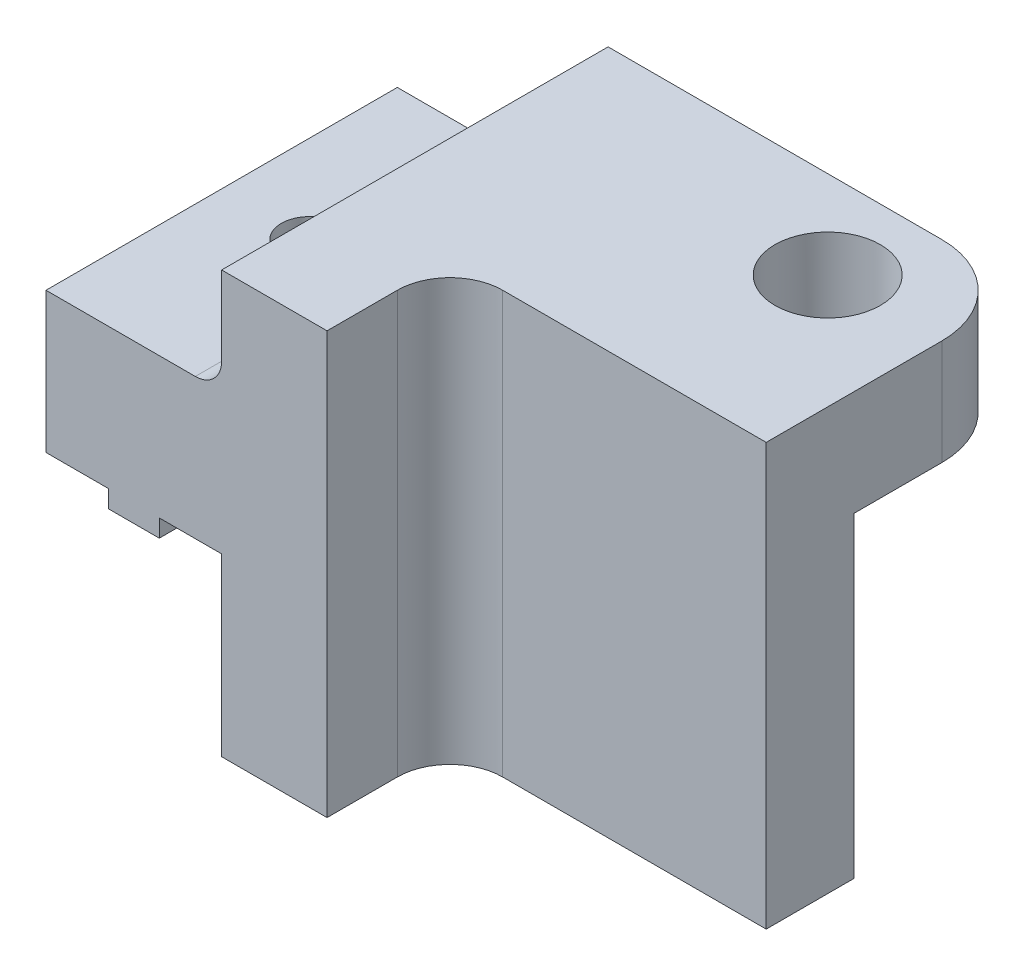
ISO-10303-21;
HEADER;
FILE_DESCRIPTION(('STEP AP214'),'2;1');
FILE_NAME('part.step','',(''),(''),'','','');
FILE_SCHEMA(('AUTOMOTIVE_DESIGN { 1 0 10303 214 1 1 1 1 }'));
ENDSEC;
DATA;
#1=APPLICATION_CONTEXT('core data for automotive mechanical design processes');
#2=APPLICATION_PROTOCOL_DEFINITION('international standard','automotive_design',2000,#1);
#3=PRODUCT_CONTEXT('',#1,'mechanical');
#4=PRODUCT('Part','Part','',(#3));
#5=PRODUCT_RELATED_PRODUCT_CATEGORY('part','',(#4));
#6=PRODUCT_DEFINITION_FORMATION('','',#4);
#7=PRODUCT_DEFINITION_CONTEXT('part definition',#1,'design');
#8=PRODUCT_DEFINITION('design','',#6,#7);
#9=PRODUCT_DEFINITION_SHAPE('','',#8);
#10=(LENGTH_UNIT() NAMED_UNIT(*) SI_UNIT(.MILLI.,.METRE.));
#11=(NAMED_UNIT(*) PLANE_ANGLE_UNIT() SI_UNIT($,.RADIAN.));
#12=(NAMED_UNIT(*) SI_UNIT($,.STERADIAN.) SOLID_ANGLE_UNIT());
#13=UNCERTAINTY_MEASURE_WITH_UNIT(LENGTH_MEASURE(1.E-05),#10,'distance_accuracy_value','');
#14=(GEOMETRIC_REPRESENTATION_CONTEXT(3) GLOBAL_UNCERTAINTY_ASSIGNED_CONTEXT((#13)) GLOBAL_UNIT_ASSIGNED_CONTEXT((#10,
#11,#12)) REPRESENTATION_CONTEXT('',''));
#15=CARTESIAN_POINT('',(0.,0.,0.));
#16=DIRECTION('',(0.,0.,1.));
#17=DIRECTION('',(1.,0.,0.));
#18=AXIS2_PLACEMENT_3D('',#15,#16,#17);
#19=CARTESIAN_POINT('',(36.45,-2.00000000000001,22.));
#20=DIRECTION('',(-1.,0.,0.));
#21=DIRECTION('',(0.,1.,0.));
#22=AXIS2_PLACEMENT_3D('',#19,#20,#21);
#23=PLANE('',#22);
#24=DIRECTION('',(0.,0.,-1.));
#25=VECTOR('',#24,1.);
#26=CARTESIAN_POINT('',(36.45,-3.00000000000001,22.));
#27=LINE('',#26,#25);
#28=CARTESIAN_POINT('',(36.45,-3.00000000000001,11.3236125370765));
#29=VERTEX_POINT('',#28);
#30=CARTESIAN_POINT('',(36.45,-3.00000000000001,2.));
#31=VERTEX_POINT('',#30);
#32=EDGE_CURVE('E246',#29,#31,#27,.T.);
#33=ORIENTED_EDGE('',*,*,#32,.T.);
#34=DIRECTION('',(0.,-1.,0.));
#35=VECTOR('',#34,1.);
#36=CARTESIAN_POINT('',(36.45,-2.00000000000001,2.));
#37=LINE('',#36,#35);
#38=CARTESIAN_POINT('',(36.45,-2.00000000000001,2.));
#39=VERTEX_POINT('',#38);
#40=EDGE_CURVE('E457',#39,#31,#37,.T.);
#41=ORIENTED_EDGE('',*,*,#40,.F.);
#42=DIRECTION('',(0.,0.,-1.));
#43=VECTOR('',#42,1.);
#44=CARTESIAN_POINT('',(36.45,-2.00000000000001,22.));
#45=LINE('',#44,#43);
#46=CARTESIAN_POINT('',(36.45,-2.00000000000001,11.3236125370764));
#47=VERTEX_POINT('',#46);
#48=EDGE_CURVE('E250',#47,#39,#45,.T.);
#49=ORIENTED_EDGE('',*,*,#48,.F.);
#50=DIRECTION('',(0.,1.,0.));
#51=VECTOR('',#50,1.);
#52=CARTESIAN_POINT('',(36.45,-12.,11.3236125370764));
#53=LINE('',#52,#51);
#54=EDGE_CURVE('E521',#29,#47,#53,.T.);
#55=ORIENTED_EDGE('',*,*,#54,.F.);
#56=EDGE_LOOP('',(#33,#41,#49,#55));
#57=FACE_BOUND('',#56,.T.);
#58=ADVANCED_FACE('F33',(#57),#23,.F.);
#59=CARTESIAN_POINT('',(36.45,-3.00000000000001,22.));
#60=DIRECTION('',(0.,1.,0.));
#61=DIRECTION('',(1.,0.,0.));
#62=AXIS2_PLACEMENT_3D('',#59,#60,#61);
#63=PLANE('',#62);
#64=CARTESIAN_POINT('',(36.45,-3.00000000000001,22.));
#65=VERTEX_POINT('',#64);
#66=CARTESIAN_POINT('',(36.45,-3.00000000000001,12.6763874629234));
#67=VERTEX_POINT('',#66);
#68=EDGE_CURVE('E247',#65,#67,#27,.T.);
#69=ORIENTED_EDGE('',*,*,#68,.F.);
#70=DIRECTION('',(-1.,0.,0.));
#71=VECTOR('',#70,1.);
#72=CARTESIAN_POINT('',(36.45,-3.00000000000001,22.));
#73=LINE('',#72,#71);
#74=CARTESIAN_POINT('',(33.55,-3.00000000000001,22.));
#75=VERTEX_POINT('',#74);
#76=EDGE_CURVE('E390',#65,#75,#73,.T.);
#77=ORIENTED_EDGE('',*,*,#76,.T.);
#78=DIRECTION('',(0.,0.,-1.));
#79=VECTOR('',#78,1.);
#80=CARTESIAN_POINT('',(33.55,-3.00000000000001,22.));
#81=LINE('',#80,#79);
#82=CARTESIAN_POINT('',(33.5500000000001,-3.00000000000001,12.6763874629236));
#83=VERTEX_POINT('',#82);
#84=EDGE_CURVE('E240',#75,#83,#81,.T.);
#85=ORIENTED_EDGE('',*,*,#84,.T.);
#86=CARTESIAN_POINT('',(35.,-3.00000000000001,12.));
#87=DIRECTION('',(0.,-1.,0.));
#88=DIRECTION('',(1.,0.,0.));
#89=AXIS2_PLACEMENT_3D('',#86,#87,#88);
#90=CIRCLE('',#89,1.6);
#91=EDGE_CURVE('E228',#67,#83,#90,.T.);
#92=ORIENTED_EDGE('',*,*,#91,.F.);
#93=EDGE_LOOP('',(#69,#77,#85,#92));
#94=FACE_BOUND('',#93,.T.);
#95=ADVANCED_FACE('F499',(#94),#63,.F.);
#96=CARTESIAN_POINT('',(33.55,-3.00000000000001,22.));
#97=DIRECTION('',(1.,0.,0.));
#98=DIRECTION('',(0.,-1.,0.));
#99=AXIS2_PLACEMENT_3D('',#96,#97,#98);
#100=PLANE('',#99);
#101=ORIENTED_EDGE('',*,*,#84,.F.);
#102=DIRECTION('',(0.,1.,0.));
#103=VECTOR('',#102,1.);
#104=CARTESIAN_POINT('',(33.55,-3.00000000000001,22.));
#105=LINE('',#104,#103);
#106=CARTESIAN_POINT('',(33.55,-2.00000000000001,22.));
#107=VERTEX_POINT('',#106);
#108=EDGE_CURVE('E236',#75,#107,#105,.T.);
#109=ORIENTED_EDGE('',*,*,#108,.T.);
#110=DIRECTION('',(0.,0.,-1.));
#111=VECTOR('',#110,1.);
#112=CARTESIAN_POINT('',(33.55,-2.00000000000001,22.));
#113=LINE('',#112,#111);
#114=CARTESIAN_POINT('',(33.55,-2.00000000000001,12.6763874629234));
#115=VERTEX_POINT('',#114);
#116=EDGE_CURVE('E214',#107,#115,#113,.T.);
#117=ORIENTED_EDGE('',*,*,#116,.T.);
#118=DIRECTION('',(0.,1.,0.));
#119=VECTOR('',#118,1.);
#120=CARTESIAN_POINT('',(33.5500000000001,-12.,12.6763874629236));
#121=LINE('',#120,#119);
#122=EDGE_CURVE('E224',#83,#115,#121,.T.);
#123=ORIENTED_EDGE('',*,*,#122,.F.);
#124=EDGE_LOOP('',(#101,#109,#117,#123));
#125=FACE_BOUND('',#124,.T.);
#126=ADVANCED_FACE('F235',(#125),#100,.F.);
#127=CARTESIAN_POINT('',(30.,-2.00000000000002,22.));
#128=DIRECTION('',(1.,0.,0.));
#129=DIRECTION('',(0.,-1.,0.));
#130=AXIS2_PLACEMENT_3D('',#127,#128,#129);
#131=PLANE('',#130);
#132=DIRECTION('',(0.,0.,-1.));
#133=VECTOR('',#132,1.);
#134=CARTESIAN_POINT('',(30.,-2.00000000000002,22.));
#135=LINE('',#134,#133);
#136=CARTESIAN_POINT('',(30.,-2.00000000000002,22.));
#137=VERTEX_POINT('',#136);
#138=CARTESIAN_POINT('',(30.,-2.00000000000001,2.));
#139=VERTEX_POINT('',#138);
#140=EDGE_CURVE('E242',#137,#139,#135,.T.);
#141=ORIENTED_EDGE('',*,*,#140,.F.);
#142=DIRECTION('',(0.,1.,0.));
#143=VECTOR('',#142,1.);
#144=CARTESIAN_POINT('',(30.,-2.00000000000002,22.));
#145=LINE('',#144,#143);
#146=CARTESIAN_POINT('',(30.,5.99999999999999,22.));
#147=VERTEX_POINT('',#146);
#148=EDGE_CURVE('E368',#137,#147,#145,.T.);
#149=ORIENTED_EDGE('',*,*,#148,.T.);
#150=DIRECTION('',(0.,0.,-1.));
#151=VECTOR('',#150,1.);
#152=CARTESIAN_POINT('',(30.,5.99999999999999,22.));
#153=LINE('',#152,#151);
#154=CARTESIAN_POINT('',(30.,5.99999999999999,2.));
#155=VERTEX_POINT('',#154);
#156=EDGE_CURVE('E269',#147,#155,#153,.T.);
#157=ORIENTED_EDGE('',*,*,#156,.T.);
#158=DIRECTION('',(0.,1.,0.));
#159=VECTOR('',#158,1.);
#160=CARTESIAN_POINT('',(30.,-12.,2.));
#161=LINE('',#160,#159);
#162=EDGE_CURVE('E462',#139,#155,#161,.T.);
#163=ORIENTED_EDGE('',*,*,#162,.F.);
#164=EDGE_LOOP('',(#141,#149,#157,#163));
#165=FACE_BOUND('',#164,.T.);
#166=ADVANCED_FACE('F541',(#165),#131,.F.);
#167=CARTESIAN_POINT('',(30.,5.99999999999999,22.));
#168=DIRECTION('',(0.,-1.,0.));
#169=DIRECTION('',(0.,0.,-1.));
#170=AXIS2_PLACEMENT_3D('',#167,#168,#169);
#171=PLANE('',#170);
#172=CARTESIAN_POINT('',(35.,5.99999999999999,12.));
#173=DIRECTION('',(0.,-1.,0.));
#174=DIRECTION('',(0.,0.,1.));
#175=AXIS2_PLACEMENT_3D('',#172,#173,#174);
#176=CIRCLE('',#175,1.6);
#177=CARTESIAN_POINT('',(35.,5.99999999999999,13.6));
#178=VERTEX_POINT('',#177);
#179=EDGE_CURVE('E529',#178,#178,#176,.T.);
#180=ORIENTED_EDGE('',*,*,#179,.T.);
#181=EDGE_LOOP('',(#180));
#182=FACE_BOUND('',#181,.T.);
#183=DIRECTION('',(-1.,0.,0.));
#184=VECTOR('',#183,1.);
#185=CARTESIAN_POINT('',(40.,5.99999999999999,2.));
#186=LINE('',#185,#184);
#187=CARTESIAN_POINT('',(38.5,5.99999999999999,2.));
#188=VERTEX_POINT('',#187);
#189=EDGE_CURVE('E463',#188,#155,#186,.T.);
#190=ORIENTED_EDGE('',*,*,#189,.T.);
#191=ORIENTED_EDGE('',*,*,#156,.F.);
#192=DIRECTION('',(1.,0.,0.));
#193=VECTOR('',#192,1.);
#194=CARTESIAN_POINT('',(30.,5.99999999999999,22.));
#195=LINE('',#194,#193);
#196=CARTESIAN_POINT('',(38.5,5.99999999999999,22.));
#197=VERTEX_POINT('',#196);
#198=EDGE_CURVE('E371',#147,#197,#195,.T.);
#199=ORIENTED_EDGE('',*,*,#198,.T.);
#200=DIRECTION('',(0.,0.,-1.));
#201=VECTOR('',#200,1.);
#202=CARTESIAN_POINT('',(38.5,5.99999999999999,22.));
#203=LINE('',#202,#201);
#204=EDGE_CURVE('E300',#188,#197,#203,.F.);
#205=ORIENTED_EDGE('',*,*,#204,.F.);
#206=EDGE_LOOP('',(#190,#191,#199,#205));
#207=FACE_BOUND('',#206,.T.);
#208=ADVANCED_FACE('F545',(#182,#207),#171,.F.);
#209=CARTESIAN_POINT('',(40.,12.,22.));
#210=DIRECTION('',(0.,-1.,0.));
#211=DIRECTION('',(0.,0.,-1.));
#212=AXIS2_PLACEMENT_3D('',#209,#210,#211);
#213=PLANE('',#212);
#214=CARTESIAN_POINT('',(57.5,12.,5.));
#215=DIRECTION('',(0.,1.,0.));
#216=DIRECTION('',(0.,0.,-1.));
#217=AXIS2_PLACEMENT_3D('',#214,#215,#216);
#218=CIRCLE('',#217,3.);
#219=CARTESIAN_POINT('',(57.5,12.,2.));
#220=VERTEX_POINT('',#219);
#221=EDGE_CURVE('E276',#220,#220,#218,.T.);
#222=ORIENTED_EDGE('',*,*,#221,.F.);
#223=EDGE_LOOP('',(#222));
#224=FACE_BOUND('',#223,.T.);
#225=DIRECTION('',(1.,0.,0.));
#226=VECTOR('',#225,1.);
#227=CARTESIAN_POINT('',(21.,12.,15.));
#228=LINE('',#227,#226);
#229=CARTESIAN_POINT('',(49.,12.,15.));
#230=VERTEX_POINT('',#229);
#231=CARTESIAN_POINT('',(64.,12.,15.));
#232=VERTEX_POINT('',#231);
#233=EDGE_CURVE('E320',#230,#232,#228,.T.);
#234=ORIENTED_EDGE('',*,*,#233,.T.);
#235=DIRECTION('',(0.,0.,-1.));
#236=VECTOR('',#235,1.);
#237=CARTESIAN_POINT('',(64.,12.,22.));
#238=LINE('',#237,#236);
#239=CARTESIAN_POINT('',(64.,12.,5.));
#240=VERTEX_POINT('',#239);
#241=EDGE_CURVE('E263',#232,#240,#238,.T.);
#242=ORIENTED_EDGE('',*,*,#241,.T.);
#243=CARTESIAN_POINT('',(59.,12.,5.));
#244=DIRECTION('',(0.,1.,0.));
#245=DIRECTION('',(0.,0.,-1.));
#246=AXIS2_PLACEMENT_3D('',#243,#244,#245);
#247=CIRCLE('',#246,5.);
#248=CARTESIAN_POINT('',(59.,12.,0.));
#249=VERTEX_POINT('',#248);
#250=EDGE_CURVE('E291',#249,#240,#247,.F.);
#251=ORIENTED_EDGE('',*,*,#250,.F.);
#252=DIRECTION('',(1.,0.,0.));
#253=VECTOR('',#252,1.);
#254=CARTESIAN_POINT('',(40.,12.,0.));
#255=LINE('',#254,#253);
#256=CARTESIAN_POINT('',(40.,12.,0.));
#257=VERTEX_POINT('',#256);
#258=EDGE_CURVE('E365',#257,#249,#255,.T.);
#259=ORIENTED_EDGE('',*,*,#258,.F.);
#260=DIRECTION('',(0.,0.,-1.));
#261=VECTOR('',#260,1.);
#262=CARTESIAN_POINT('',(40.,12.,22.));
#263=LINE('',#262,#261);
#264=CARTESIAN_POINT('',(40.,12.,22.));
#265=VERTEX_POINT('',#264);
#266=EDGE_CURVE('E266',#265,#257,#263,.T.);
#267=ORIENTED_EDGE('',*,*,#266,.F.);
#268=DIRECTION('',(1.,0.,0.));
#269=VECTOR('',#268,1.);
#270=CARTESIAN_POINT('',(40.,12.,22.));
#271=LINE('',#270,#269);
#272=CARTESIAN_POINT('',(46.,12.,22.));
#273=VERTEX_POINT('',#272);
#274=EDGE_CURVE('E377',#265,#273,#271,.T.);
#275=ORIENTED_EDGE('',*,*,#274,.T.);
#276=DIRECTION('',(0.,0.,-1.));
#277=VECTOR('',#276,1.);
#278=CARTESIAN_POINT('',(46.,12.,22.));
#279=LINE('',#278,#277);
#280=CARTESIAN_POINT('',(46.,12.,18.));
#281=VERTEX_POINT('',#280);
#282=EDGE_CURVE('E324',#273,#281,#279,.T.);
#283=ORIENTED_EDGE('',*,*,#282,.T.);
#284=CARTESIAN_POINT('',(49.,12.,18.));
#285=DIRECTION('',(0.,1.,0.));
#286=DIRECTION('',(0.,0.,-1.));
#287=AXIS2_PLACEMENT_3D('',#284,#285,#286);
#288=CIRCLE('',#287,3.);
#289=EDGE_CURVE('E11',#230,#281,#288,.T.);
#290=ORIENTED_EDGE('',*,*,#289,.F.);
#291=EDGE_LOOP('',(#234,#242,#251,#259,#267,#275,#283,#290));
#292=FACE_BOUND('',#291,.T.);
#293=ADVANCED_FACE('F414',(#224,#292),#213,.F.);
#294=CARTESIAN_POINT('',(64.,12.,22.));
#295=DIRECTION('',(-1.,0.,0.));
#296=DIRECTION('',(0.,0.,-1.));
#297=AXIS2_PLACEMENT_3D('',#294,#295,#296);
#298=PLANE('',#297);
#299=DIRECTION('',(0.,0.,-1.));
#300=VECTOR('',#299,1.);
#301=CARTESIAN_POINT('',(64.,-12.,22.));
#302=LINE('',#301,#300);
#303=CARTESIAN_POINT('',(64.,-12.,15.));
#304=VERTEX_POINT('',#303);
#305=CARTESIAN_POINT('',(64.,-12.,10.));
#306=VERTEX_POINT('',#305);
#307=EDGE_CURVE('E260',#304,#306,#302,.T.);
#308=ORIENTED_EDGE('',*,*,#307,.T.);
#309=DIRECTION('',(0.,-1.,0.));
#310=VECTOR('',#309,1.);
#311=CARTESIAN_POINT('',(64.,6.,10.));
#312=LINE('',#311,#310);
#313=CARTESIAN_POINT('',(64.,6.,10.));
#314=VERTEX_POINT('',#313);
#315=EDGE_CURVE('E348',#314,#306,#312,.T.);
#316=ORIENTED_EDGE('',*,*,#315,.F.);
#317=DIRECTION('',(0.,0.,1.));
#318=VECTOR('',#317,1.);
#319=CARTESIAN_POINT('',(64.,6.,10.));
#320=LINE('',#319,#318);
#321=CARTESIAN_POINT('',(64.,6.,5.));
#322=VERTEX_POINT('',#321);
#323=EDGE_CURVE('E351',#322,#314,#320,.T.);
#324=ORIENTED_EDGE('',*,*,#323,.F.);
#325=DIRECTION('',(0.,-1.,0.));
#326=VECTOR('',#325,1.);
#327=CARTESIAN_POINT('',(64.,12.,5.));
#328=LINE('',#327,#326);
#329=EDGE_CURVE('E286',#240,#322,#328,.T.);
#330=ORIENTED_EDGE('',*,*,#329,.F.);
#331=ORIENTED_EDGE('',*,*,#241,.F.);
#332=DIRECTION('',(0.,-1.,0.));
#333=VECTOR('',#332,1.);
#334=CARTESIAN_POINT('',(64.,-12.,15.));
#335=LINE('',#334,#333);
#336=EDGE_CURVE('E456',#232,#304,#335,.T.);
#337=ORIENTED_EDGE('',*,*,#336,.T.);
#338=EDGE_LOOP('',(#308,#316,#324,#330,#331,#337));
#339=FACE_BOUND('',#338,.T.);
#340=ADVANCED_FACE('F484',(#339),#298,.F.);
#341=CARTESIAN_POINT('',(64.,-12.,22.));
#342=DIRECTION('',(0.,1.,0.));
#343=DIRECTION('',(1.,0.,0.));
#344=AXIS2_PLACEMENT_3D('',#341,#342,#343);
#345=PLANE('',#344);
#346=DIRECTION('',(-1.,0.,0.));
#347=VECTOR('',#346,1.);
#348=CARTESIAN_POINT('',(64.,-12.,22.));
#349=LINE('',#348,#347);
#350=CARTESIAN_POINT('',(46.,-12.,22.));
#351=VERTEX_POINT('',#350);
#352=CARTESIAN_POINT('',(40.,-12.,22.));
#353=VERTEX_POINT('',#352);
#354=EDGE_CURVE('E380',#351,#353,#349,.T.);
#355=ORIENTED_EDGE('',*,*,#354,.T.);
#356=DIRECTION('',(0.,0.,-1.));
#357=VECTOR('',#356,1.);
#358=CARTESIAN_POINT('',(40.,-12.,22.));
#359=LINE('',#358,#357);
#360=CARTESIAN_POINT('',(40.,-12.,0.));
#361=VERTEX_POINT('',#360);
#362=EDGE_CURVE('E257',#353,#361,#359,.T.);
#363=ORIENTED_EDGE('',*,*,#362,.T.);
#364=DIRECTION('',(-1.,0.,0.));
#365=VECTOR('',#364,1.);
#366=CARTESIAN_POINT('',(64.,-12.,0.));
#367=LINE('',#366,#365);
#368=CARTESIAN_POINT('',(43.,-12.,0.));
#369=VERTEX_POINT('',#368);
#370=EDGE_CURVE('E398',#369,#361,#367,.T.);
#371=ORIENTED_EDGE('',*,*,#370,.F.);
#372=DIRECTION('',(0.,0.,-1.));
#373=VECTOR('',#372,1.);
#374=CARTESIAN_POINT('',(43.,-12.,33.259406699226));
#375=LINE('',#374,#373);
#376=CARTESIAN_POINT('',(43.,-12.,10.));
#377=VERTEX_POINT('',#376);
#378=EDGE_CURVE('E342',#377,#369,#375,.T.);
#379=ORIENTED_EDGE('',*,*,#378,.F.);
#380=DIRECTION('',(1.,0.,0.));
#381=VECTOR('',#380,1.);
#382=CARTESIAN_POINT('',(64.,-12.,10.));
#383=LINE('',#382,#381);
#384=EDGE_CURVE('E339',#377,#306,#383,.T.);
#385=ORIENTED_EDGE('',*,*,#384,.T.);
#386=ORIENTED_EDGE('',*,*,#307,.F.);
#387=DIRECTION('',(1.,0.,0.));
#388=VECTOR('',#387,1.);
#389=CARTESIAN_POINT('',(21.,-12.,15.));
#390=LINE('',#389,#388);
#391=CARTESIAN_POINT('',(49.,-12.,15.));
#392=VERTEX_POINT('',#391);
#393=EDGE_CURVE('E315',#392,#304,#390,.T.);
#394=ORIENTED_EDGE('',*,*,#393,.F.);
#395=CARTESIAN_POINT('',(49.,-12.,18.));
#396=DIRECTION('',(0.,-1.,0.));
#397=DIRECTION('',(1.,0.,0.));
#398=AXIS2_PLACEMENT_3D('',#395,#396,#397);
#399=CIRCLE('',#398,3.);
#400=CARTESIAN_POINT('',(46.,-12.,18.));
#401=VERTEX_POINT('',#400);
#402=EDGE_CURVE('E41',#401,#392,#399,.T.);
#403=ORIENTED_EDGE('',*,*,#402,.F.);
#404=DIRECTION('',(0.,0.,1.));
#405=VECTOR('',#404,1.);
#406=CARTESIAN_POINT('',(46.,-12.,22.));
#407=LINE('',#406,#405);
#408=EDGE_CURVE('E319',#401,#351,#407,.T.);
#409=ORIENTED_EDGE('',*,*,#408,.T.);
#410=EDGE_LOOP('',(#355,#363,#371,#379,#385,#386,#394,#403,#409));
#411=FACE_BOUND('',#410,.T.);
#412=ADVANCED_FACE('F317',(#411),#345,.F.);
#413=CARTESIAN_POINT('',(40.,-12.,22.));
#414=DIRECTION('',(1.,0.,0.));
#415=DIRECTION('',(0.,-1.,0.));
#416=AXIS2_PLACEMENT_3D('',#413,#414,#415);
#417=PLANE('',#416);
#418=DIRECTION('',(0.,1.,0.));
#419=VECTOR('',#418,1.);
#420=CARTESIAN_POINT('',(40.,5.99999999999999,22.));
#421=LINE('',#420,#419);
#422=CARTESIAN_POINT('',(40.,7.49999999999998,22.));
#423=VERTEX_POINT('',#422);
#424=EDGE_CURVE('E375',#423,#265,#421,.T.);
#425=ORIENTED_EDGE('',*,*,#424,.T.);
#426=ORIENTED_EDGE('',*,*,#266,.T.);
#427=DIRECTION('',(0.,1.,0.));
#428=VECTOR('',#427,1.);
#429=CARTESIAN_POINT('',(40.,-12.,0.));
#430=LINE('',#429,#428);
#431=EDGE_CURVE('E372',#361,#257,#430,.T.);
#432=ORIENTED_EDGE('',*,*,#431,.F.);
#433=ORIENTED_EDGE('',*,*,#362,.F.);
#434=DIRECTION('',(0.,1.,0.));
#435=VECTOR('',#434,1.);
#436=CARTESIAN_POINT('',(40.,-12.,22.));
#437=LINE('',#436,#435);
#438=CARTESIAN_POINT('',(40.,-2.00000000000001,22.));
#439=VERTEX_POINT('',#438);
#440=EDGE_CURVE('E382',#353,#439,#437,.T.);
#441=ORIENTED_EDGE('',*,*,#440,.T.);
#442=DIRECTION('',(0.,0.,-1.));
#443=VECTOR('',#442,1.);
#444=CARTESIAN_POINT('',(40.,-2.00000000000001,22.));
#445=LINE('',#444,#443);
#446=CARTESIAN_POINT('',(40.,-2.00000000000001,2.));
#447=VERTEX_POINT('',#446);
#448=EDGE_CURVE('E254',#439,#447,#445,.T.);
#449=ORIENTED_EDGE('',*,*,#448,.T.);
#450=DIRECTION('',(0.,1.,0.));
#451=VECTOR('',#450,1.);
#452=CARTESIAN_POINT('',(40.,-12.,2.));
#453=LINE('',#452,#451);
#454=CARTESIAN_POINT('',(40.,7.49999999999998,2.));
#455=VERTEX_POINT('',#454);
#456=EDGE_CURVE('E459',#447,#455,#453,.T.);
#457=ORIENTED_EDGE('',*,*,#456,.T.);
#458=DIRECTION('',(0.,0.,-1.));
#459=VECTOR('',#458,1.);
#460=CARTESIAN_POINT('',(40.,7.49999999999998,2.));
#461=LINE('',#460,#459);
#462=EDGE_CURVE('E220',#423,#455,#461,.T.);
#463=ORIENTED_EDGE('',*,*,#462,.F.);
#464=EDGE_LOOP('',(#425,#426,#432,#433,#441,#449,#457,#463));
#465=FACE_BOUND('',#464,.T.);
#466=ADVANCED_FACE('F409',(#465),#417,.F.);
#467=CARTESIAN_POINT('',(40.,-2.00000000000001,22.));
#468=DIRECTION('',(0.,1.,0.));
#469=DIRECTION('',(1.,0.,0.));
#470=AXIS2_PLACEMENT_3D('',#467,#468,#469);
#471=PLANE('',#470);
#472=ORIENTED_EDGE('',*,*,#48,.T.);
#473=DIRECTION('',(-1.,0.,0.));
#474=VECTOR('',#473,1.);
#475=CARTESIAN_POINT('',(40.,-2.00000000000001,2.));
#476=LINE('',#475,#474);
#477=EDGE_CURVE('E450',#447,#39,#476,.T.);
#478=ORIENTED_EDGE('',*,*,#477,.F.);
#479=ORIENTED_EDGE('',*,*,#448,.F.);
#480=DIRECTION('',(-1.,0.,0.));
#481=VECTOR('',#480,1.);
#482=CARTESIAN_POINT('',(40.,-2.00000000000001,22.));
#483=LINE('',#482,#481);
#484=CARTESIAN_POINT('',(36.45,-2.00000000000001,22.));
#485=VERTEX_POINT('',#484);
#486=EDGE_CURVE('E385',#439,#485,#483,.T.);
#487=ORIENTED_EDGE('',*,*,#486,.T.);
#488=CARTESIAN_POINT('',(36.45,-2.00000000000001,12.6763874629235));
#489=VERTEX_POINT('',#488);
#490=EDGE_CURVE('E251',#485,#489,#45,.T.);
#491=ORIENTED_EDGE('',*,*,#490,.T.);
#492=CARTESIAN_POINT('',(35.,-2.00000000000001,12.));
#493=DIRECTION('',(0.,-1.,0.));
#494=DIRECTION('',(1.,0.,0.));
#495=AXIS2_PLACEMENT_3D('',#492,#493,#494);
#496=CIRCLE('',#495,1.6);
#497=EDGE_CURVE('E468',#47,#489,#496,.T.);
#498=ORIENTED_EDGE('',*,*,#497,.F.);
#499=EDGE_LOOP('',(#472,#478,#479,#487,#491,#498));
#500=FACE_BOUND('',#499,.T.);
#501=ADVANCED_FACE('F449',(#500),#471,.F.);
#502=ORIENTED_EDGE('',*,*,#490,.F.);
#503=DIRECTION('',(0.,-1.,0.));
#504=VECTOR('',#503,1.);
#505=CARTESIAN_POINT('',(36.45,-2.00000000000001,22.));
#506=LINE('',#505,#504);
#507=EDGE_CURVE('E388',#485,#65,#506,.T.);
#508=ORIENTED_EDGE('',*,*,#507,.T.);
#509=ORIENTED_EDGE('',*,*,#68,.T.);
#510=DIRECTION('',(0.,1.,0.));
#511=VECTOR('',#510,1.);
#512=CARTESIAN_POINT('',(36.45,-12.,12.6763874629235));
#513=LINE('',#512,#511);
#514=EDGE_CURVE('E519',#489,#67,#513,.F.);
#515=ORIENTED_EDGE('',*,*,#514,.F.);
#516=EDGE_LOOP('',(#502,#508,#509,#515));
#517=FACE_BOUND('',#516,.T.);
#518=ADVANCED_FACE('F502',(#517),#23,.F.);
#519=CARTESIAN_POINT('',(33.5500000000001,-3.00000000000001,11.3236125370764));
#520=VERTEX_POINT('',#519);
#521=CARTESIAN_POINT('',(33.55,-3.00000000000001,2.));
#522=VERTEX_POINT('',#521);
#523=EDGE_CURVE('E237',#520,#522,#81,.T.);
#524=ORIENTED_EDGE('',*,*,#523,.T.);
#525=DIRECTION('',(-1.,0.,0.));
#526=VECTOR('',#525,1.);
#527=CARTESIAN_POINT('',(36.45,-3.00000000000001,2.));
#528=LINE('',#527,#526);
#529=EDGE_CURVE('E473',#31,#522,#528,.T.);
#530=ORIENTED_EDGE('',*,*,#529,.F.);
#531=ORIENTED_EDGE('',*,*,#32,.F.);
#532=EDGE_CURVE('E232',#520,#29,#90,.T.);
#533=ORIENTED_EDGE('',*,*,#532,.F.);
#534=EDGE_LOOP('',(#524,#530,#531,#533));
#535=FACE_BOUND('',#534,.T.);
#536=ADVANCED_FACE('F508',(#535),#63,.F.);
#537=CARTESIAN_POINT('',(33.55,-2.00000000000001,11.3236125370766));
#538=VERTEX_POINT('',#537);
#539=CARTESIAN_POINT('',(33.55,-2.00000000000001,2.));
#540=VERTEX_POINT('',#539);
#541=EDGE_CURVE('E217',#538,#540,#113,.T.);
#542=ORIENTED_EDGE('',*,*,#541,.T.);
#543=DIRECTION('',(0.,1.,0.));
#544=VECTOR('',#543,1.);
#545=CARTESIAN_POINT('',(33.55,-3.00000000000001,2.));
#546=LINE('',#545,#544);
#547=EDGE_CURVE('E466',#522,#540,#546,.T.);
#548=ORIENTED_EDGE('',*,*,#547,.F.);
#549=ORIENTED_EDGE('',*,*,#523,.F.);
#550=DIRECTION('',(0.,1.,0.));
#551=VECTOR('',#550,1.);
#552=CARTESIAN_POINT('',(33.5500000000001,-12.,11.3236125370764));
#553=LINE('',#552,#551);
#554=EDGE_CURVE('E233',#538,#520,#553,.F.);
#555=ORIENTED_EDGE('',*,*,#554,.F.);
#556=EDGE_LOOP('',(#542,#548,#549,#555));
#557=FACE_BOUND('',#556,.T.);
#558=ADVANCED_FACE('F517',(#557),#100,.F.);
#559=CARTESIAN_POINT('',(33.55,-2.00000000000001,22.));
#560=DIRECTION('',(0.,1.,0.));
#561=DIRECTION('',(1.,0.,0.));
#562=AXIS2_PLACEMENT_3D('',#559,#560,#561);
#563=PLANE('',#562);
#564=ORIENTED_EDGE('',*,*,#116,.F.);
#565=DIRECTION('',(-1.,0.,0.));
#566=VECTOR('',#565,1.);
#567=CARTESIAN_POINT('',(33.55,-2.00000000000001,22.));
#568=LINE('',#567,#566);
#569=EDGE_CURVE('E394',#107,#137,#568,.T.);
#570=ORIENTED_EDGE('',*,*,#569,.T.);
#571=ORIENTED_EDGE('',*,*,#140,.T.);
#572=DIRECTION('',(-1.,0.,0.));
#573=VECTOR('',#572,1.);
#574=CARTESIAN_POINT('',(33.55,-2.00000000000001,2.));
#575=LINE('',#574,#573);
#576=EDGE_CURVE('E221',#540,#139,#575,.T.);
#577=ORIENTED_EDGE('',*,*,#576,.F.);
#578=ORIENTED_EDGE('',*,*,#541,.F.);
#579=CARTESIAN_POINT('',(35.,-2.00000000000001,12.));
#580=DIRECTION('',(0.,-1.,0.));
#581=DIRECTION('',(1.,0.,0.));
#582=AXIS2_PLACEMENT_3D('',#579,#580,#581);
#583=CIRCLE('',#582,1.6);
#584=EDGE_CURVE('E210',#115,#538,#583,.T.);
#585=ORIENTED_EDGE('',*,*,#584,.F.);
#586=EDGE_LOOP('',(#564,#570,#571,#577,#578,#585));
#587=FACE_BOUND('',#586,.T.);
#588=ADVANCED_FACE('F212',(#587),#563,.F.);
#589=CARTESIAN_POINT('',(52.,0.,22.));
#590=DIRECTION('',(0.,0.,1.));
#591=DIRECTION('',(-1.,0.,0.));
#592=AXIS2_PLACEMENT_3D('',#589,#590,#591);
#593=PLANE('',#592);
#594=DIRECTION('',(0.,1.,0.));
#595=VECTOR('',#594,1.);
#596=CARTESIAN_POINT('',(46.,-12.,22.));
#597=LINE('',#596,#595);
#598=EDGE_CURVE('E277',#351,#273,#597,.T.);
#599=ORIENTED_EDGE('',*,*,#598,.T.);
#600=ORIENTED_EDGE('',*,*,#274,.F.);
#601=ORIENTED_EDGE('',*,*,#424,.F.);
#602=CARTESIAN_POINT('',(38.5,7.49999999999998,22.));
#603=DIRECTION('',(0.,0.,-1.));
#604=DIRECTION('',(-1.,0.,0.));
#605=AXIS2_PLACEMENT_3D('',#602,#603,#604);
#606=CIRCLE('',#605,1.5);
#607=EDGE_CURVE('E305',#197,#423,#606,.F.);
#608=ORIENTED_EDGE('',*,*,#607,.F.);
#609=ORIENTED_EDGE('',*,*,#198,.F.);
#610=ORIENTED_EDGE('',*,*,#148,.F.);
#611=ORIENTED_EDGE('',*,*,#569,.F.);
#612=ORIENTED_EDGE('',*,*,#108,.F.);
#613=ORIENTED_EDGE('',*,*,#76,.F.);
#614=ORIENTED_EDGE('',*,*,#507,.F.);
#615=ORIENTED_EDGE('',*,*,#486,.F.);
#616=ORIENTED_EDGE('',*,*,#440,.F.);
#617=ORIENTED_EDGE('',*,*,#354,.F.);
#618=EDGE_LOOP('',(#599,#600,#601,#608,#609,#610,#611,#612,#613,#614,#615,#616,#617));
#619=FACE_BOUND('',#618,.T.);
#620=ADVANCED_FACE('F444',(#619),#593,.T.);
#621=CARTESIAN_POINT('',(52.,0.,0.));
#622=DIRECTION('',(0.,0.,1.));
#623=DIRECTION('',(-1.,0.,0.));
#624=AXIS2_PLACEMENT_3D('',#621,#622,#623);
#625=PLANE('',#624);
#626=ORIENTED_EDGE('',*,*,#258,.T.);
#627=DIRECTION('',(0.,-1.,0.));
#628=VECTOR('',#627,1.);
#629=CARTESIAN_POINT('',(59.,0.,0.));
#630=LINE('',#629,#628);
#631=CARTESIAN_POINT('',(59.,6.,0.));
#632=VERTEX_POINT('',#631);
#633=EDGE_CURVE('E289',#632,#249,#630,.F.);
#634=ORIENTED_EDGE('',*,*,#633,.F.);
#635=DIRECTION('',(-1.,0.,0.));
#636=VECTOR('',#635,1.);
#637=CARTESIAN_POINT('',(64.,6.,0.));
#638=LINE('',#637,#636);
#639=CARTESIAN_POINT('',(51.,6.,0.));
#640=VERTEX_POINT('',#639);
#641=EDGE_CURVE('E355',#632,#640,#638,.T.);
#642=ORIENTED_EDGE('',*,*,#641,.T.);
#643=CARTESIAN_POINT('',(51.,1.,0.));
#644=DIRECTION('',(0.,0.,-1.));
#645=DIRECTION('',(-1.,0.,0.));
#646=AXIS2_PLACEMENT_3D('',#643,#644,#645);
#647=CIRCLE('',#646,5.);
#648=CARTESIAN_POINT('',(46.,1.,0.));
#649=VERTEX_POINT('',#648);
#650=EDGE_CURVE('E294',#649,#640,#647,.T.);
#651=ORIENTED_EDGE('',*,*,#650,.F.);
#652=DIRECTION('',(0.,1.,0.));
#653=VECTOR('',#652,1.);
#654=CARTESIAN_POINT('',(46.,6.,0.));
#655=LINE('',#654,#653);
#656=CARTESIAN_POINT('',(46.,-2.00000000000002,0.));
#657=VERTEX_POINT('',#656);
#658=EDGE_CURVE('E352',#657,#649,#655,.T.);
#659=ORIENTED_EDGE('',*,*,#658,.F.);
#660=DIRECTION('',(-1.,0.,0.));
#661=VECTOR('',#660,1.);
#662=CARTESIAN_POINT('',(64.,-2.00000000000001,0.));
#663=LINE('',#662,#661);
#664=CARTESIAN_POINT('',(43.,-2.00000000000002,0.));
#665=VERTEX_POINT('',#664);
#666=EDGE_CURVE('E330',#657,#665,#663,.T.);
#667=ORIENTED_EDGE('',*,*,#666,.T.);
#668=DIRECTION('',(0.,-1.,0.));
#669=VECTOR('',#668,1.);
#670=CARTESIAN_POINT('',(43.,-2.00000000000002,0.));
#671=LINE('',#670,#669);
#672=EDGE_CURVE('E331',#665,#369,#671,.T.);
#673=ORIENTED_EDGE('',*,*,#672,.T.);
#674=ORIENTED_EDGE('',*,*,#370,.T.);
#675=ORIENTED_EDGE('',*,*,#431,.T.);
#676=EDGE_LOOP('',(#626,#634,#642,#651,#659,#667,#673,#674,#675));
#677=FACE_BOUND('',#676,.T.);
#678=ADVANCED_FACE('F401',(#677),#625,.F.);
#679=CARTESIAN_POINT('',(64.,6.,10.));
#680=DIRECTION('',(0.,0.,1.));
#681=DIRECTION('',(-1.,0.,0.));
#682=AXIS2_PLACEMENT_3D('',#679,#680,#681);
#683=PLANE('',#682);
#684=DIRECTION('',(-1.,0.,0.));
#685=VECTOR('',#684,1.);
#686=CARTESIAN_POINT('',(64.,6.,10.));
#687=LINE('',#686,#685);
#688=CARTESIAN_POINT('',(51.,6.,10.));
#689=VERTEX_POINT('',#688);
#690=EDGE_CURVE('E362',#314,#689,#687,.T.);
#691=ORIENTED_EDGE('',*,*,#690,.F.);
#692=ORIENTED_EDGE('',*,*,#315,.T.);
#693=ORIENTED_EDGE('',*,*,#384,.F.);
#694=DIRECTION('',(0.,-1.,0.));
#695=VECTOR('',#694,1.);
#696=CARTESIAN_POINT('',(43.,-2.00000000000002,10.));
#697=LINE('',#696,#695);
#698=CARTESIAN_POINT('',(43.,-2.00000000000002,10.));
#699=VERTEX_POINT('',#698);
#700=EDGE_CURVE('E343',#699,#377,#697,.T.);
#701=ORIENTED_EDGE('',*,*,#700,.F.);
#702=DIRECTION('',(-1.,0.,0.));
#703=VECTOR('',#702,1.);
#704=CARTESIAN_POINT('',(64.,-2.00000000000001,10.));
#705=LINE('',#704,#703);
#706=CARTESIAN_POINT('',(46.,-2.00000000000001,10.));
#707=VERTEX_POINT('',#706);
#708=EDGE_CURVE('E333',#707,#699,#705,.T.);
#709=ORIENTED_EDGE('',*,*,#708,.F.);
#710=DIRECTION('',(0.,-1.,0.));
#711=VECTOR('',#710,1.);
#712=CARTESIAN_POINT('',(46.,6.,10.));
#713=LINE('',#712,#711);
#714=CARTESIAN_POINT('',(46.,1.,10.));
#715=VERTEX_POINT('',#714);
#716=EDGE_CURVE('E341',#715,#707,#713,.T.);
#717=ORIENTED_EDGE('',*,*,#716,.F.);
#718=CARTESIAN_POINT('',(51.,1.,10.));
#719=DIRECTION('',(0.,0.,-1.));
#720=DIRECTION('',(-1.,0.,0.));
#721=AXIS2_PLACEMENT_3D('',#718,#719,#720);
#722=CIRCLE('',#721,5.);
#723=EDGE_CURVE('E281',#689,#715,#722,.F.);
#724=ORIENTED_EDGE('',*,*,#723,.F.);
#725=EDGE_LOOP('',(#691,#692,#693,#701,#709,#717,#724));
#726=FACE_BOUND('',#725,.T.);
#727=ADVANCED_FACE('F487',(#726),#683,.F.);
#728=CARTESIAN_POINT('',(64.,6.,10.));
#729=DIRECTION('',(0.,1.,0.));
#730=DIRECTION('',(0.,0.,1.));
#731=AXIS2_PLACEMENT_3D('',#728,#729,#730);
#732=PLANE('',#731);
#733=CARTESIAN_POINT('',(57.5,6.,5.));
#734=DIRECTION('',(0.,-1.,0.));
#735=DIRECTION('',(0.,0.,1.));
#736=AXIS2_PLACEMENT_3D('',#733,#734,#735);
#737=CIRCLE('',#736,3.);
#738=CARTESIAN_POINT('',(57.5,6.,8.));
#739=VERTEX_POINT('',#738);
#740=EDGE_CURVE('E273',#739,#739,#737,.T.);
#741=ORIENTED_EDGE('',*,*,#740,.F.);
#742=EDGE_LOOP('',(#741));
#743=FACE_BOUND('',#742,.T.);
#744=ORIENTED_EDGE('',*,*,#641,.F.);
#745=CARTESIAN_POINT('',(59.,6.,5.));
#746=DIRECTION('',(0.,-1.,0.));
#747=DIRECTION('',(0.,0.,1.));
#748=AXIS2_PLACEMENT_3D('',#745,#746,#747);
#749=CIRCLE('',#748,5.);
#750=EDGE_CURVE('E272',#322,#632,#749,.F.);
#751=ORIENTED_EDGE('',*,*,#750,.F.);
#752=ORIENTED_EDGE('',*,*,#323,.T.);
#753=ORIENTED_EDGE('',*,*,#690,.T.);
#754=DIRECTION('',(0.,0.,1.));
#755=VECTOR('',#754,1.);
#756=CARTESIAN_POINT('',(51.,6.,10.));
#757=LINE('',#756,#755);
#758=EDGE_CURVE('E279',#640,#689,#757,.T.);
#759=ORIENTED_EDGE('',*,*,#758,.F.);
#760=EDGE_LOOP('',(#744,#751,#752,#753,#759));
#761=FACE_BOUND('',#760,.T.);
#762=ADVANCED_FACE('F423',(#743,#761),#732,.F.);
#763=CARTESIAN_POINT('',(46.,0.,0.));
#764=DIRECTION('',(-1.,0.,0.));
#765=DIRECTION('',(0.,0.,-1.));
#766=AXIS2_PLACEMENT_3D('',#763,#764,#765);
#767=PLANE('',#766);
#768=ORIENTED_EDGE('',*,*,#716,.T.);
#769=DIRECTION('',(0.,0.,-1.));
#770=VECTOR('',#769,1.);
#771=CARTESIAN_POINT('',(46.,-2.00000000000001,10.));
#772=LINE('',#771,#770);
#773=EDGE_CURVE('E358',#707,#657,#772,.T.);
#774=ORIENTED_EDGE('',*,*,#773,.T.);
#775=ORIENTED_EDGE('',*,*,#658,.T.);
#776=DIRECTION('',(0.,0.,1.));
#777=VECTOR('',#776,1.);
#778=CARTESIAN_POINT('',(46.,1.,0.));
#779=LINE('',#778,#777);
#780=EDGE_CURVE('E284',#715,#649,#779,.F.);
#781=ORIENTED_EDGE('',*,*,#780,.F.);
#782=EDGE_LOOP('',(#768,#774,#775,#781));
#783=FACE_BOUND('',#782,.T.);
#784=ADVANCED_FACE('F429',(#783),#767,.F.);
#785=CARTESIAN_POINT('',(64.,-2.00000000000001,33.259406699226));
#786=DIRECTION('',(0.,1.,0.));
#787=DIRECTION('',(1.,0.,0.));
#788=AXIS2_PLACEMENT_3D('',#785,#786,#787);
#789=PLANE('',#788);
#790=ORIENTED_EDGE('',*,*,#666,.F.);
#791=ORIENTED_EDGE('',*,*,#773,.F.);
#792=ORIENTED_EDGE('',*,*,#708,.T.);
#793=DIRECTION('',(0.,0.,-1.));
#794=VECTOR('',#793,1.);
#795=CARTESIAN_POINT('',(43.,-2.00000000000002,33.259406699226));
#796=LINE('',#795,#794);
#797=EDGE_CURVE('E338',#699,#665,#796,.T.);
#798=ORIENTED_EDGE('',*,*,#797,.T.);
#799=EDGE_LOOP('',(#790,#791,#792,#798));
#800=FACE_BOUND('',#799,.T.);
#801=ADVANCED_FACE('F433',(#800),#789,.F.);
#802=CARTESIAN_POINT('',(43.,-2.00000000000002,33.259406699226));
#803=DIRECTION('',(-1.,0.,0.));
#804=DIRECTION('',(0.,1.,0.));
#805=AXIS2_PLACEMENT_3D('',#802,#803,#804);
#806=PLANE('',#805);
#807=ORIENTED_EDGE('',*,*,#797,.F.);
#808=ORIENTED_EDGE('',*,*,#700,.T.);
#809=ORIENTED_EDGE('',*,*,#378,.T.);
#810=ORIENTED_EDGE('',*,*,#672,.F.);
#811=EDGE_LOOP('',(#807,#808,#809,#810));
#812=FACE_BOUND('',#811,.T.);
#813=ADVANCED_FACE('F437',(#812),#806,.F.);
#814=CARTESIAN_POINT('',(57.5,-12.,5.));
#815=DIRECTION('',(0.,1.,0.));
#816=DIRECTION('',(0.,0.,1.));
#817=AXIS2_PLACEMENT_3D('',#814,#815,#816);
#818=CYLINDRICAL_SURFACE('',#817,3.);
#819=ORIENTED_EDGE('',*,*,#740,.T.);
#820=EDGE_LOOP('',(#819));
#821=FACE_BOUND('',#820,.T.);
#822=ORIENTED_EDGE('',*,*,#221,.T.);
#823=EDGE_LOOP('',(#822));
#824=FACE_BOUND('',#823,.T.);
#825=ADVANCED_FACE('F560',(#821,#824),#818,.F.);
#826=CARTESIAN_POINT('',(51.,1.,10.));
#827=DIRECTION('',(0.,0.,-1.));
#828=DIRECTION('',(1.,0.,0.));
#829=AXIS2_PLACEMENT_3D('',#826,#827,#828);
#830=CYLINDRICAL_SURFACE('',#829,5.);
#831=ORIENTED_EDGE('',*,*,#650,.T.);
#832=ORIENTED_EDGE('',*,*,#758,.T.);
#833=ORIENTED_EDGE('',*,*,#723,.T.);
#834=ORIENTED_EDGE('',*,*,#780,.T.);
#835=EDGE_LOOP('',(#831,#832,#833,#834));
#836=FACE_BOUND('',#835,.T.);
#837=ADVANCED_FACE('F426',(#836),#830,.F.);
#838=CARTESIAN_POINT('',(59.,12.,5.));
#839=DIRECTION('',(0.,-1.,0.));
#840=DIRECTION('',(0.,0.,-1.));
#841=AXIS2_PLACEMENT_3D('',#838,#839,#840);
#842=CYLINDRICAL_SURFACE('',#841,5.);
#843=ORIENTED_EDGE('',*,*,#250,.T.);
#844=ORIENTED_EDGE('',*,*,#329,.T.);
#845=ORIENTED_EDGE('',*,*,#750,.T.);
#846=ORIENTED_EDGE('',*,*,#633,.T.);
#847=EDGE_LOOP('',(#843,#844,#845,#846));
#848=FACE_BOUND('',#847,.T.);
#849=ADVANCED_FACE('F417',(#848),#842,.T.);
#850=CARTESIAN_POINT('',(46.,0.,0.));
#851=DIRECTION('',(-1.,0.,0.));
#852=DIRECTION('',(0.,0.,-1.));
#853=AXIS2_PLACEMENT_3D('',#850,#851,#852);
#854=PLANE('',#853);
#855=ORIENTED_EDGE('',*,*,#282,.F.);
#856=ORIENTED_EDGE('',*,*,#598,.F.);
#857=ORIENTED_EDGE('',*,*,#408,.F.);
#858=DIRECTION('',(0.,-1.,0.));
#859=VECTOR('',#858,1.);
#860=CARTESIAN_POINT('',(46.,-12.,18.));
#861=LINE('',#860,#859);
#862=EDGE_CURVE('E307',#281,#401,#861,.T.);
#863=ORIENTED_EDGE('',*,*,#862,.F.);
#864=EDGE_LOOP('',(#855,#856,#857,#863));
#865=FACE_BOUND('',#864,.T.);
#866=ADVANCED_FACE('F481',(#865),#854,.F.);
#867=CARTESIAN_POINT('',(21.,-12.,15.));
#868=DIRECTION('',(0.,0.,-1.));
#869=DIRECTION('',(1.,0.,0.));
#870=AXIS2_PLACEMENT_3D('',#867,#868,#869);
#871=PLANE('',#870);
#872=ORIENTED_EDGE('',*,*,#393,.T.);
#873=ORIENTED_EDGE('',*,*,#336,.F.);
#874=ORIENTED_EDGE('',*,*,#233,.F.);
#875=DIRECTION('',(0.,-1.,0.));
#876=VECTOR('',#875,1.);
#877=CARTESIAN_POINT('',(49.,12.,15.));
#878=LINE('',#877,#876);
#879=EDGE_CURVE('E48',#392,#230,#878,.F.);
#880=ORIENTED_EDGE('',*,*,#879,.F.);
#881=EDGE_LOOP('',(#872,#873,#874,#880));
#882=FACE_BOUND('',#881,.T.);
#883=ADVANCED_FACE('F482',(#882),#871,.F.);
#884=CARTESIAN_POINT('',(40.,-12.,2.));
#885=DIRECTION('',(0.,0.,1.));
#886=DIRECTION('',(-1.,0.,0.));
#887=AXIS2_PLACEMENT_3D('',#884,#885,#886);
#888=PLANE('',#887);
#889=ORIENTED_EDGE('',*,*,#456,.F.);
#890=ORIENTED_EDGE('',*,*,#477,.T.);
#891=ORIENTED_EDGE('',*,*,#40,.T.);
#892=ORIENTED_EDGE('',*,*,#529,.T.);
#893=ORIENTED_EDGE('',*,*,#547,.T.);
#894=ORIENTED_EDGE('',*,*,#576,.T.);
#895=ORIENTED_EDGE('',*,*,#162,.T.);
#896=ORIENTED_EDGE('',*,*,#189,.F.);
#897=CARTESIAN_POINT('',(38.5,7.49999999999998,2.));
#898=DIRECTION('',(0.,0.,-1.));
#899=DIRECTION('',(-1.,0.,0.));
#900=AXIS2_PLACEMENT_3D('',#897,#898,#899);
#901=CIRCLE('',#900,1.5);
#902=EDGE_CURVE('E303',#455,#188,#901,.T.);
#903=ORIENTED_EDGE('',*,*,#902,.F.);
#904=EDGE_LOOP('',(#889,#890,#891,#892,#893,#894,#895,#896,#903));
#905=FACE_BOUND('',#904,.T.);
#906=ADVANCED_FACE('F460',(#905),#888,.F.);
#907=CARTESIAN_POINT('',(35.,-12.,12.));
#908=DIRECTION('',(0.,1.,0.));
#909=DIRECTION('',(0.,0.,1.));
#910=AXIS2_PLACEMENT_3D('',#907,#908,#909);
#911=CYLINDRICAL_SURFACE('',#910,1.6);
#912=ORIENTED_EDGE('',*,*,#179,.F.);
#913=EDGE_LOOP('',(#912));
#914=FACE_BOUND('',#913,.T.);
#915=ORIENTED_EDGE('',*,*,#54,.T.);
#916=ORIENTED_EDGE('',*,*,#497,.T.);
#917=ORIENTED_EDGE('',*,*,#514,.T.);
#918=ORIENTED_EDGE('',*,*,#91,.T.);
#919=ORIENTED_EDGE('',*,*,#122,.T.);
#920=ORIENTED_EDGE('',*,*,#584,.T.);
#921=ORIENTED_EDGE('',*,*,#554,.T.);
#922=ORIENTED_EDGE('',*,*,#532,.T.);
#923=EDGE_LOOP('',(#915,#916,#917,#918,#919,#920,#921,#922));
#924=FACE_BOUND('',#923,.T.);
#925=ADVANCED_FACE('F226',(#914,#924),#911,.F.);
#926=CARTESIAN_POINT('',(38.5,7.49999999999998,22.));
#927=DIRECTION('',(0.,0.,1.));
#928=DIRECTION('',(-1.,0.,0.));
#929=AXIS2_PLACEMENT_3D('',#926,#927,#928);
#930=CYLINDRICAL_SURFACE('',#929,1.5);
#931=ORIENTED_EDGE('',*,*,#607,.T.);
#932=ORIENTED_EDGE('',*,*,#462,.T.);
#933=ORIENTED_EDGE('',*,*,#902,.T.);
#934=ORIENTED_EDGE('',*,*,#204,.T.);
#935=EDGE_LOOP('',(#931,#932,#933,#934));
#936=FACE_BOUND('',#935,.T.);
#937=ADVANCED_FACE('F547',(#936),#930,.F.);
#938=CARTESIAN_POINT('',(49.,0.,18.));
#939=DIRECTION('',(0.,1.,0.));
#940=DIRECTION('',(0.,0.,1.));
#941=AXIS2_PLACEMENT_3D('',#938,#939,#940);
#942=CYLINDRICAL_SURFACE('',#941,3.);
#943=ORIENTED_EDGE('',*,*,#289,.T.);
#944=ORIENTED_EDGE('',*,*,#862,.T.);
#945=ORIENTED_EDGE('',*,*,#402,.T.);
#946=ORIENTED_EDGE('',*,*,#879,.T.);
#947=EDGE_LOOP('',(#943,#944,#945,#946));
#948=FACE_BOUND('',#947,.T.);
#949=ADVANCED_FACE('F35',(#948),#942,.F.);
#950=CLOSED_SHELL('',(#58,#95,#126,#166,#208,#293,#340,#412,#466,#501,#518,#536,#558,#588,#620,
#678,#727,#762,#784,#801,#813,#825,#837,#849,#866,#883,#906,#925,#937,#949));
#951=MANIFOLD_SOLID_BREP('B2',#950);
#952=ADVANCED_BREP_SHAPE_REPRESENTATION('',(#18,#951),#14);
#953=SHAPE_DEFINITION_REPRESENTATION(#9,#952);
ENDSEC;
END-ISO-10303-21;
